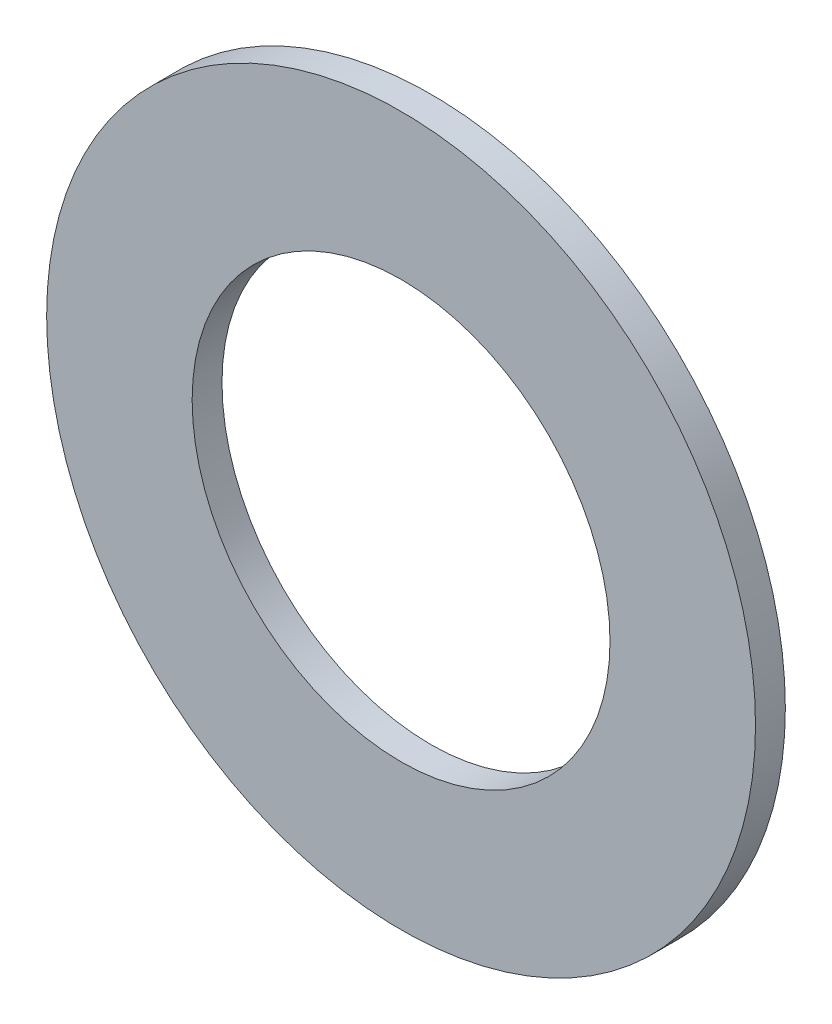
ISO-10303-21;
HEADER;
FILE_DESCRIPTION(('STEP AP214'),'2;1');
FILE_NAME('part.step','',(''),(''),'','','');
FILE_SCHEMA(('AUTOMOTIVE_DESIGN { 1 0 10303 214 1 1 1 1 }'));
ENDSEC;
DATA;
#1=APPLICATION_CONTEXT('core data for automotive mechanical design processes');
#2=APPLICATION_PROTOCOL_DEFINITION('international standard','automotive_design',2000,#1);
#3=PRODUCT_CONTEXT('',#1,'mechanical');
#4=PRODUCT('Part','Part','',(#3));
#5=PRODUCT_RELATED_PRODUCT_CATEGORY('part','',(#4));
#6=PRODUCT_DEFINITION_FORMATION('','',#4);
#7=PRODUCT_DEFINITION_CONTEXT('part definition',#1,'design');
#8=PRODUCT_DEFINITION('design','',#6,#7);
#9=PRODUCT_DEFINITION_SHAPE('','',#8);
#10=(LENGTH_UNIT() NAMED_UNIT(*) SI_UNIT(.MILLI.,.METRE.));
#11=(NAMED_UNIT(*) PLANE_ANGLE_UNIT() SI_UNIT($,.RADIAN.));
#12=(NAMED_UNIT(*) SI_UNIT($,.STERADIAN.) SOLID_ANGLE_UNIT());
#13=UNCERTAINTY_MEASURE_WITH_UNIT(LENGTH_MEASURE(1.E-05),#10,'distance_accuracy_value','');
#14=(GEOMETRIC_REPRESENTATION_CONTEXT(3) GLOBAL_UNCERTAINTY_ASSIGNED_CONTEXT((#13)) GLOBAL_UNIT_ASSIGNED_CONTEXT((#10,
#11,#12)) REPRESENTATION_CONTEXT('',''));
#15=CARTESIAN_POINT('',(0.,0.,0.));
#16=DIRECTION('',(0.,0.,1.));
#17=DIRECTION('',(1.,0.,0.));
#18=AXIS2_PLACEMENT_3D('',#15,#16,#17);
#19=CARTESIAN_POINT('',(0.,0.,0.508));
#20=DIRECTION('',(0.,0.,1.));
#21=DIRECTION('',(1.,0.,0.));
#22=AXIS2_PLACEMENT_3D('',#19,#20,#21);
#23=PLANE('',#22);
#24=CARTESIAN_POINT('',(0.,0.,0.508));
#25=DIRECTION('',(0.,0.,1.));
#26=DIRECTION('',(1.,0.,0.));
#27=AXIS2_PLACEMENT_3D('',#24,#25,#26);
#28=CIRCLE('',#27,6.03250000000004);
#29=CARTESIAN_POINT('',(6.03249999999999,0.,0.508));
#30=VERTEX_POINT('',#29);
#31=EDGE_CURVE('E10',#30,#30,#28,.T.);
#32=ORIENTED_EDGE('',*,*,#31,.T.);
#33=EDGE_LOOP('',(#32));
#34=FACE_BOUND('',#33,.T.);
#35=CARTESIAN_POINT('',(0.,0.,0.508));
#36=DIRECTION('',(0.,0.,1.));
#37=DIRECTION('',(1.,0.,0.));
#38=AXIS2_PLACEMENT_3D('',#35,#36,#37);
#39=CIRCLE('',#38,3.55600000000004);
#40=CARTESIAN_POINT('',(3.55599999999999,0.,0.508));
#41=VERTEX_POINT('',#40);
#42=EDGE_CURVE('E52',#41,#41,#39,.T.);
#43=ORIENTED_EDGE('',*,*,#42,.F.);
#44=EDGE_LOOP('',(#43));
#45=FACE_BOUND('',#44,.T.);
#46=ADVANCED_FACE('F41',(#34,#45),#23,.T.);
#47=CARTESIAN_POINT('',(0.,0.,0.));
#48=DIRECTION('',(0.,0.,1.));
#49=DIRECTION('',(1.,0.,0.));
#50=AXIS2_PLACEMENT_3D('',#47,#48,#49);
#51=PLANE('',#50);
#52=CARTESIAN_POINT('',(0.,0.,0.));
#53=DIRECTION('',(0.,0.,1.));
#54=DIRECTION('',(1.,0.,0.));
#55=AXIS2_PLACEMENT_3D('',#52,#53,#54);
#56=CIRCLE('',#55,6.03250000000004);
#57=CARTESIAN_POINT('',(6.03249999999999,0.,0.));
#58=VERTEX_POINT('',#57);
#59=EDGE_CURVE('E45',#58,#58,#56,.T.);
#60=ORIENTED_EDGE('',*,*,#59,.F.);
#61=EDGE_LOOP('',(#60));
#62=FACE_BOUND('',#61,.T.);
#63=CARTESIAN_POINT('',(0.,0.,0.));
#64=DIRECTION('',(0.,0.,1.));
#65=DIRECTION('',(1.,0.,0.));
#66=AXIS2_PLACEMENT_3D('',#63,#64,#65);
#67=CIRCLE('',#66,3.55600000000004);
#68=CARTESIAN_POINT('',(3.55599999999999,0.,0.));
#69=VERTEX_POINT('',#68);
#70=EDGE_CURVE('E54',#69,#69,#67,.T.);
#71=ORIENTED_EDGE('',*,*,#70,.T.);
#72=EDGE_LOOP('',(#71));
#73=FACE_BOUND('',#72,.T.);
#74=ADVANCED_FACE('F64',(#62,#73),#51,.F.);
#75=CARTESIAN_POINT('',(0.,0.,0.508));
#76=DIRECTION('',(0.,0.,-1.));
#77=DIRECTION('',(-1.,0.,0.));
#78=AXIS2_PLACEMENT_3D('',#75,#76,#77);
#79=CYLINDRICAL_SURFACE('',#78,6.03250000000004);
#80=ORIENTED_EDGE('',*,*,#31,.F.);
#81=EDGE_LOOP('',(#80));
#82=FACE_BOUND('',#81,.T.);
#83=ORIENTED_EDGE('',*,*,#59,.T.);
#84=EDGE_LOOP('',(#83));
#85=FACE_BOUND('',#84,.T.);
#86=ADVANCED_FACE('F43',(#82,#85),#79,.T.);
#87=CARTESIAN_POINT('',(0.,0.,0.508));
#88=DIRECTION('',(0.,0.,-1.));
#89=DIRECTION('',(-1.,0.,0.));
#90=AXIS2_PLACEMENT_3D('',#87,#88,#89);
#91=CYLINDRICAL_SURFACE('',#90,3.55600000000004);
#92=ORIENTED_EDGE('',*,*,#42,.T.);
#93=EDGE_LOOP('',(#92));
#94=FACE_BOUND('',#93,.T.);
#95=ORIENTED_EDGE('',*,*,#70,.F.);
#96=EDGE_LOOP('',(#95));
#97=FACE_BOUND('',#96,.T.);
#98=ADVANCED_FACE('F60',(#94,#97),#91,.F.);
#99=CLOSED_SHELL('',(#46,#74,#86,#98));
#100=MANIFOLD_SOLID_BREP('B2',#99);
#101=ADVANCED_BREP_SHAPE_REPRESENTATION('',(#18,#100),#14);
#102=SHAPE_DEFINITION_REPRESENTATION(#9,#101);
ENDSEC;
END-ISO-10303-21;
